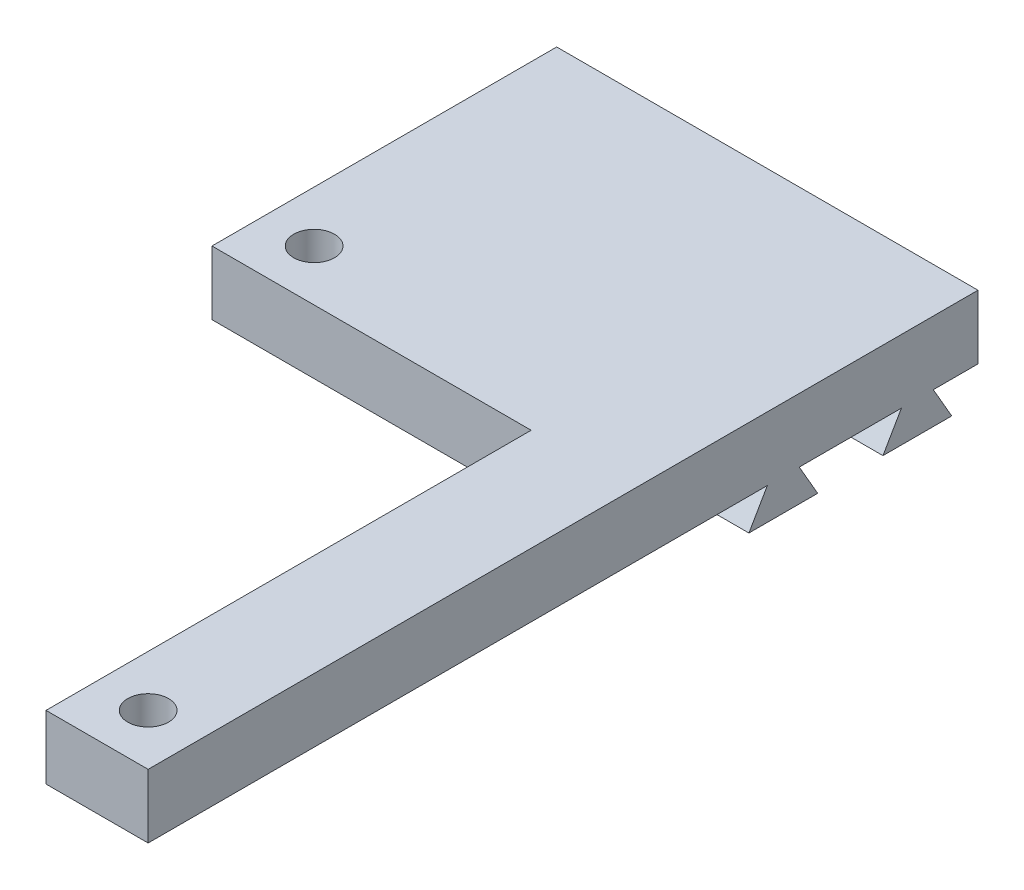
ISO-10303-21;
HEADER;
FILE_DESCRIPTION(('STEP AP214'),'2;1');
FILE_NAME('part.step','',(''),(''),'','','');
FILE_SCHEMA(('AUTOMOTIVE_DESIGN { 1 0 10303 214 1 1 1 1 }'));
ENDSEC;
DATA;
#1=APPLICATION_CONTEXT('core data for automotive mechanical design processes');
#2=APPLICATION_PROTOCOL_DEFINITION('international standard','automotive_design',2000,#1);
#3=PRODUCT_CONTEXT('',#1,'mechanical');
#4=PRODUCT('Part','Part','',(#3));
#5=PRODUCT_RELATED_PRODUCT_CATEGORY('part','',(#4));
#6=PRODUCT_DEFINITION_FORMATION('','',#4);
#7=PRODUCT_DEFINITION_CONTEXT('part definition',#1,'design');
#8=PRODUCT_DEFINITION('design','',#6,#7);
#9=PRODUCT_DEFINITION_SHAPE('','',#8);
#10=(LENGTH_UNIT() NAMED_UNIT(*) SI_UNIT(.MILLI.,.METRE.));
#11=(NAMED_UNIT(*) PLANE_ANGLE_UNIT() SI_UNIT($,.RADIAN.));
#12=(NAMED_UNIT(*) SI_UNIT($,.STERADIAN.) SOLID_ANGLE_UNIT());
#13=UNCERTAINTY_MEASURE_WITH_UNIT(LENGTH_MEASURE(1.E-05),#10,'distance_accuracy_value','');
#14=(GEOMETRIC_REPRESENTATION_CONTEXT(3) GLOBAL_UNCERTAINTY_ASSIGNED_CONTEXT((#13)) GLOBAL_UNIT_ASSIGNED_CONTEXT((#10,
#11,#12)) REPRESENTATION_CONTEXT('',''));
#15=CARTESIAN_POINT('',(0.,0.,0.));
#16=DIRECTION('',(0.,0.,1.));
#17=DIRECTION('',(1.,0.,0.));
#18=AXIS2_PLACEMENT_3D('',#15,#16,#17);
#19=CARTESIAN_POINT('',(0.,0.,0.));
#20=DIRECTION('',(0.,-1.,0.));
#21=DIRECTION('',(0.,0.,-1.));
#22=AXIS2_PLACEMENT_3D('',#19,#20,#21);
#23=PLANE('',#22);
#24=CARTESIAN_POINT('',(-12.5,0.,-7.));
#25=DIRECTION('',(0.,-1.,0.));
#26=DIRECTION('',(0.,0.,-1.));
#27=AXIS2_PLACEMENT_3D('',#24,#25,#26);
#28=CIRCLE('',#27,1.6);
#29=CARTESIAN_POINT('',(-12.5,0.,-8.6));
#30=VERTEX_POINT('',#29);
#31=EDGE_CURVE('E165',#30,#30,#28,.T.);
#32=ORIENTED_EDGE('',*,*,#31,.F.);
#33=EDGE_LOOP('',(#32));
#34=FACE_BOUND('',#33,.T.);
#35=CARTESIAN_POINT('',(12.5,0.,31.));
#36=DIRECTION('',(0.,-1.,0.));
#37=DIRECTION('',(0.,0.,-1.));
#38=AXIS2_PLACEMENT_3D('',#35,#36,#37);
#39=CIRCLE('',#38,1.6);
#40=CARTESIAN_POINT('',(12.5,0.,29.4));
#41=VERTEX_POINT('',#40);
#42=EDGE_CURVE('E168',#41,#41,#39,.T.);
#43=ORIENTED_EDGE('',*,*,#42,.F.);
#44=EDGE_LOOP('',(#43));
#45=FACE_BOUND('',#44,.T.);
#46=DIRECTION('',(0.,0.,1.));
#47=VECTOR('',#46,1.);
#48=CARTESIAN_POINT('',(-16.5,0.,-10.));
#49=LINE('',#48,#47);
#50=CARTESIAN_POINT('',(-16.5,0.,-13.5));
#51=VERTEX_POINT('',#50);
#52=CARTESIAN_POINT('',(-16.5,0.,-3.));
#53=VERTEX_POINT('',#52);
#54=EDGE_CURVE('E243',#51,#53,#49,.T.);
#55=ORIENTED_EDGE('',*,*,#54,.F.);
#56=DIRECTION('',(-1.,0.,0.));
#57=VECTOR('',#56,1.);
#58=CARTESIAN_POINT('',(16.5,0.,-13.5));
#59=LINE('',#58,#57);
#60=CARTESIAN_POINT('',(16.5,0.,-13.5));
#61=VERTEX_POINT('',#60);
#62=EDGE_CURVE('E191',#61,#51,#59,.T.);
#63=ORIENTED_EDGE('',*,*,#62,.F.);
#64=DIRECTION('',(0.,0.,-1.));
#65=VECTOR('',#64,1.);
#66=CARTESIAN_POINT('',(16.5,0.,30.));
#67=LINE('',#66,#65);
#68=CARTESIAN_POINT('',(16.5,0.,35.));
#69=VERTEX_POINT('',#68);
#70=EDGE_CURVE('E155',#69,#61,#67,.T.);
#71=ORIENTED_EDGE('',*,*,#70,.F.);
#72=DIRECTION('',(1.,0.,0.));
#73=VECTOR('',#72,1.);
#74=CARTESIAN_POINT('',(8.5,0.,35.));
#75=LINE('',#74,#73);
#76=CARTESIAN_POINT('',(8.5,0.,35.));
#77=VERTEX_POINT('',#76);
#78=EDGE_CURVE('E151',#77,#69,#75,.T.);
#79=ORIENTED_EDGE('',*,*,#78,.F.);
#80=DIRECTION('',(0.,0.,1.));
#81=VECTOR('',#80,1.);
#82=CARTESIAN_POINT('',(8.5,0.,-10.));
#83=LINE('',#82,#81);
#84=CARTESIAN_POINT('',(8.5,0.,-3.));
#85=VERTEX_POINT('',#84);
#86=EDGE_CURVE('E138',#85,#77,#83,.T.);
#87=ORIENTED_EDGE('',*,*,#86,.F.);
#88=DIRECTION('',(1.,0.,0.));
#89=VECTOR('',#88,1.);
#90=CARTESIAN_POINT('',(-16.5,0.,-3.));
#91=LINE('',#90,#89);
#92=EDGE_CURVE('E177',#53,#85,#91,.T.);
#93=ORIENTED_EDGE('',*,*,#92,.F.);
#94=EDGE_LOOP('',(#55,#63,#71,#79,#87,#93));
#95=FACE_BOUND('',#94,.T.);
#96=ADVANCED_FACE('F36',(#34,#45,#95),#23,.T.);
#97=CARTESIAN_POINT('',(16.5,0.,-16.));
#98=VERTEX_POINT('',#97);
#99=CARTESIAN_POINT('',(16.5,0.,-24.));
#100=VERTEX_POINT('',#99);
#101=EDGE_CURVE('E241',#98,#100,#67,.T.);
#102=ORIENTED_EDGE('',*,*,#101,.F.);
#103=DIRECTION('',(-1.,0.,0.));
#104=VECTOR('',#103,1.);
#105=CARTESIAN_POINT('',(16.5,0.,-16.));
#106=LINE('',#105,#104);
#107=CARTESIAN_POINT('',(-16.5,0.,-16.));
#108=VERTEX_POINT('',#107);
#109=EDGE_CURVE('E203',#98,#108,#106,.T.);
#110=ORIENTED_EDGE('',*,*,#109,.T.);
#111=CARTESIAN_POINT('',(-16.5,0.,-24.));
#112=VERTEX_POINT('',#111);
#113=EDGE_CURVE('E245',#112,#108,#49,.T.);
#114=ORIENTED_EDGE('',*,*,#113,.F.);
#115=DIRECTION('',(-1.,0.,0.));
#116=VECTOR('',#115,1.);
#117=CARTESIAN_POINT('',(16.5,0.,-24.));
#118=LINE('',#117,#116);
#119=EDGE_CURVE('E228',#100,#112,#118,.T.);
#120=ORIENTED_EDGE('',*,*,#119,.F.);
#121=EDGE_LOOP('',(#102,#110,#114,#120));
#122=FACE_BOUND('',#121,.T.);
#123=ADVANCED_FACE('F274',(#122),#23,.T.);
#124=CARTESIAN_POINT('',(16.5,0.,-26.5));
#125=VERTEX_POINT('',#124);
#126=CARTESIAN_POINT('',(16.5,0.,-30.));
#127=VERTEX_POINT('',#126);
#128=EDGE_CURVE('E225',#125,#127,#67,.T.);
#129=ORIENTED_EDGE('',*,*,#128,.F.);
#130=DIRECTION('',(-1.,0.,0.));
#131=VECTOR('',#130,1.);
#132=CARTESIAN_POINT('',(16.5,0.,-26.5));
#133=LINE('',#132,#131);
#134=CARTESIAN_POINT('',(-16.5,0.,-26.5));
#135=VERTEX_POINT('',#134);
#136=EDGE_CURVE('E226',#125,#135,#133,.T.);
#137=ORIENTED_EDGE('',*,*,#136,.T.);
#138=CARTESIAN_POINT('',(-16.5,0.,-30.));
#139=VERTEX_POINT('',#138);
#140=EDGE_CURVE('E148',#139,#135,#49,.T.);
#141=ORIENTED_EDGE('',*,*,#140,.F.);
#142=DIRECTION('',(-1.,0.,0.));
#143=VECTOR('',#142,1.);
#144=CARTESIAN_POINT('',(-16.5,0.,-30.));
#145=LINE('',#144,#143);
#146=EDGE_CURVE('E240',#127,#139,#145,.T.);
#147=ORIENTED_EDGE('',*,*,#146,.F.);
#148=EDGE_LOOP('',(#129,#137,#141,#147));
#149=FACE_BOUND('',#148,.T.);
#150=ADVANCED_FACE('F256',(#149),#23,.T.);
#151=CARTESIAN_POINT('',(16.5,5.,30.));
#152=DIRECTION('',(-1.,0.,0.));
#153=DIRECTION('',(0.,0.,1.));
#154=AXIS2_PLACEMENT_3D('',#151,#152,#153);
#155=PLANE('',#154);
#156=ORIENTED_EDGE('',*,*,#70,.T.);
#157=DIRECTION('',(0.,-0.866025403784436,0.500000000000004));
#158=VECTOR('',#157,1.);
#159=CARTESIAN_POINT('',(16.5,-5.84567147554499,-10.1249999999999));
#160=LINE('',#159,#158);
#161=CARTESIAN_POINT('',(16.5,-2.5,-12.0566243270259));
#162=VERTEX_POINT('',#161);
#163=EDGE_CURVE('E183',#61,#162,#160,.T.);
#164=ORIENTED_EDGE('',*,*,#163,.T.);
#165=DIRECTION('',(0.,0.,-1.));
#166=VECTOR('',#165,1.);
#167=CARTESIAN_POINT('',(16.5,-2.5,0.));
#168=LINE('',#167,#166);
#169=CARTESIAN_POINT('',(16.5,-2.5,-17.4433756729741));
#170=VERTEX_POINT('',#169);
#171=EDGE_CURVE('E189',#162,#170,#168,.T.);
#172=ORIENTED_EDGE('',*,*,#171,.T.);
#173=DIRECTION('',(0.,0.866025403784436,0.500000000000005));
#174=VECTOR('',#173,1.);
#175=CARTESIAN_POINT('',(16.5,6.92820323027555,-11.9999999999999));
#176=LINE('',#175,#174);
#177=EDGE_CURVE('E186',#170,#98,#176,.T.);
#178=ORIENTED_EDGE('',*,*,#177,.T.);
#179=ORIENTED_EDGE('',*,*,#101,.T.);
#180=DIRECTION('',(0.,0.866025403784436,-0.500000000000005));
#181=VECTOR('',#180,1.);
#182=CARTESIAN_POINT('',(16.5,-10.3923048454133,-17.9999999999999));
#183=LINE('',#182,#181);
#184=CARTESIAN_POINT('',(16.5,-2.5,-22.5566243270259));
#185=VERTEX_POINT('',#184);
#186=EDGE_CURVE('E210',#185,#100,#183,.T.);
#187=ORIENTED_EDGE('',*,*,#186,.F.);
#188=DIRECTION('',(0.,0.,1.));
#189=VECTOR('',#188,1.);
#190=CARTESIAN_POINT('',(16.5,-2.5,0.));
#191=LINE('',#190,#189);
#192=CARTESIAN_POINT('',(16.5,-2.5,-27.9433756729741));
#193=VERTEX_POINT('',#192);
#194=EDGE_CURVE('E207',#193,#185,#191,.T.);
#195=ORIENTED_EDGE('',*,*,#194,.F.);
#196=DIRECTION('',(0.,-0.866025403784436,-0.500000000000004));
#197=VECTOR('',#196,1.);
#198=CARTESIAN_POINT('',(16.5,11.4748366001439,-19.8749999999999));
#199=LINE('',#198,#197);
#200=EDGE_CURVE('E213',#125,#193,#199,.T.);
#201=ORIENTED_EDGE('',*,*,#200,.F.);
#202=ORIENTED_EDGE('',*,*,#128,.T.);
#203=DIRECTION('',(0.,-1.,0.));
#204=VECTOR('',#203,1.);
#205=CARTESIAN_POINT('',(16.5,5.,-30.));
#206=LINE('',#205,#204);
#207=CARTESIAN_POINT('',(16.5,5.,-30.));
#208=VERTEX_POINT('',#207);
#209=EDGE_CURVE('E11',#208,#127,#206,.T.);
#210=ORIENTED_EDGE('',*,*,#209,.F.);
#211=DIRECTION('',(0.,0.,-1.));
#212=VECTOR('',#211,1.);
#213=CARTESIAN_POINT('',(16.5,5.,30.));
#214=LINE('',#213,#212);
#215=CARTESIAN_POINT('',(16.5,5.,35.));
#216=VERTEX_POINT('',#215);
#217=EDGE_CURVE('E147',#216,#208,#214,.T.);
#218=ORIENTED_EDGE('',*,*,#217,.F.);
#219=DIRECTION('',(0.,1.,0.));
#220=VECTOR('',#219,1.);
#221=CARTESIAN_POINT('',(16.5,5.,35.));
#222=LINE('',#221,#220);
#223=EDGE_CURVE('E159',#69,#216,#222,.T.);
#224=ORIENTED_EDGE('',*,*,#223,.F.);
#225=EDGE_LOOP('',(#156,#164,#172,#178,#179,#187,#195,#201,#202,#210,#218,#224));
#226=FACE_BOUND('',#225,.T.);
#227=ADVANCED_FACE('F38',(#226),#155,.F.);
#228=CARTESIAN_POINT('',(-16.5,5.,-30.));
#229=DIRECTION('',(0.,0.,1.));
#230=DIRECTION('',(1.,0.,0.));
#231=AXIS2_PLACEMENT_3D('',#228,#229,#230);
#232=PLANE('',#231);
#233=ORIENTED_EDGE('',*,*,#146,.T.);
#234=DIRECTION('',(0.,-1.,0.));
#235=VECTOR('',#234,1.);
#236=CARTESIAN_POINT('',(-16.5,5.,-30.));
#237=LINE('',#236,#235);
#238=CARTESIAN_POINT('',(-16.5,5.,-30.));
#239=VERTEX_POINT('',#238);
#240=EDGE_CURVE('E44',#239,#139,#237,.T.);
#241=ORIENTED_EDGE('',*,*,#240,.F.);
#242=DIRECTION('',(-1.,0.,0.));
#243=VECTOR('',#242,1.);
#244=CARTESIAN_POINT('',(-16.5,5.,-30.));
#245=LINE('',#244,#243);
#246=EDGE_CURVE('E233',#208,#239,#245,.T.);
#247=ORIENTED_EDGE('',*,*,#246,.F.);
#248=ORIENTED_EDGE('',*,*,#209,.T.);
#249=EDGE_LOOP('',(#233,#241,#247,#248));
#250=FACE_BOUND('',#249,.T.);
#251=ADVANCED_FACE('F281',(#250),#232,.F.);
#252=CARTESIAN_POINT('',(-16.5,5.,-10.));
#253=DIRECTION('',(1.,0.,0.));
#254=DIRECTION('',(0.,0.,-1.));
#255=AXIS2_PLACEMENT_3D('',#252,#253,#254);
#256=PLANE('',#255);
#257=ORIENTED_EDGE('',*,*,#140,.T.);
#258=DIRECTION('',(0.,-0.866025403784436,-0.500000000000004));
#259=VECTOR('',#258,1.);
#260=CARTESIAN_POINT('',(-16.5,11.4748366001439,-19.8749999999999));
#261=LINE('',#260,#259);
#262=CARTESIAN_POINT('',(-16.5,-2.5,-27.9433756729741));
#263=VERTEX_POINT('',#262);
#264=EDGE_CURVE('E59',#135,#263,#261,.T.);
#265=ORIENTED_EDGE('',*,*,#264,.T.);
#266=DIRECTION('',(0.,0.,1.));
#267=VECTOR('',#266,1.);
#268=CARTESIAN_POINT('',(-16.5,-2.5,0.));
#269=LINE('',#268,#267);
#270=CARTESIAN_POINT('',(-16.5,-2.5,-22.5566243270259));
#271=VERTEX_POINT('',#270);
#272=EDGE_CURVE('E199',#263,#271,#269,.T.);
#273=ORIENTED_EDGE('',*,*,#272,.T.);
#274=DIRECTION('',(0.,0.866025403784436,-0.500000000000005));
#275=VECTOR('',#274,1.);
#276=CARTESIAN_POINT('',(-16.5,-10.3923048454133,-17.9999999999999));
#277=LINE('',#276,#275);
#278=EDGE_CURVE('E219',#271,#112,#277,.T.);
#279=ORIENTED_EDGE('',*,*,#278,.T.);
#280=ORIENTED_EDGE('',*,*,#113,.T.);
#281=DIRECTION('',(0.,0.866025403784436,0.500000000000005));
#282=VECTOR('',#281,1.);
#283=CARTESIAN_POINT('',(-16.5,6.92820323027555,-11.9999999999999));
#284=LINE('',#283,#282);
#285=CARTESIAN_POINT('',(-16.5,-2.5,-17.4433756729741));
#286=VERTEX_POINT('',#285);
#287=EDGE_CURVE('E193',#286,#108,#284,.T.);
#288=ORIENTED_EDGE('',*,*,#287,.F.);
#289=DIRECTION('',(0.,0.,-1.));
#290=VECTOR('',#289,1.);
#291=CARTESIAN_POINT('',(-16.5,-2.5,0.));
#292=LINE('',#291,#290);
#293=CARTESIAN_POINT('',(-16.5,-2.5,-12.0566243270259));
#294=VERTEX_POINT('',#293);
#295=EDGE_CURVE('E187',#294,#286,#292,.T.);
#296=ORIENTED_EDGE('',*,*,#295,.F.);
#297=DIRECTION('',(0.,-0.866025403784436,0.500000000000004));
#298=VECTOR('',#297,1.);
#299=CARTESIAN_POINT('',(-16.5,-5.84567147554499,-10.1249999999999));
#300=LINE('',#299,#298);
#301=EDGE_CURVE('E51',#51,#294,#300,.T.);
#302=ORIENTED_EDGE('',*,*,#301,.F.);
#303=ORIENTED_EDGE('',*,*,#54,.T.);
#304=DIRECTION('',(0.,-1.,0.));
#305=VECTOR('',#304,1.);
#306=CARTESIAN_POINT('',(-16.5,5.,-3.));
#307=LINE('',#306,#305);
#308=CARTESIAN_POINT('',(-16.5,5.,-3.));
#309=VERTEX_POINT('',#308);
#310=EDGE_CURVE('E174',#309,#53,#307,.T.);
#311=ORIENTED_EDGE('',*,*,#310,.F.);
#312=DIRECTION('',(0.,0.,1.));
#313=VECTOR('',#312,1.);
#314=CARTESIAN_POINT('',(-16.5,5.,-10.));
#315=LINE('',#314,#313);
#316=EDGE_CURVE('E235',#239,#309,#315,.T.);
#317=ORIENTED_EDGE('',*,*,#316,.F.);
#318=ORIENTED_EDGE('',*,*,#240,.T.);
#319=EDGE_LOOP('',(#257,#265,#273,#279,#280,#288,#296,#302,#303,#311,#317,#318));
#320=FACE_BOUND('',#319,.T.);
#321=ADVANCED_FACE('F250',(#320),#256,.F.);
#322=CARTESIAN_POINT('',(8.5,5.,-10.));
#323=DIRECTION('',(1.,0.,0.));
#324=DIRECTION('',(0.,0.,-1.));
#325=AXIS2_PLACEMENT_3D('',#322,#323,#324);
#326=PLANE('',#325);
#327=DIRECTION('',(0.,0.,1.));
#328=VECTOR('',#327,1.);
#329=CARTESIAN_POINT('',(8.5,5.,-10.));
#330=LINE('',#329,#328);
#331=CARTESIAN_POINT('',(8.5,5.,-3.));
#332=VERTEX_POINT('',#331);
#333=CARTESIAN_POINT('',(8.5,5.,35.));
#334=VERTEX_POINT('',#333);
#335=EDGE_CURVE('E237',#332,#334,#330,.T.);
#336=ORIENTED_EDGE('',*,*,#335,.F.);
#337=DIRECTION('',(0.,1.,0.));
#338=VECTOR('',#337,1.);
#339=CARTESIAN_POINT('',(8.5,5.,-3.));
#340=LINE('',#339,#338);
#341=EDGE_CURVE('E144',#85,#332,#340,.T.);
#342=ORIENTED_EDGE('',*,*,#341,.F.);
#343=ORIENTED_EDGE('',*,*,#86,.T.);
#344=DIRECTION('',(0.,-1.,0.));
#345=VECTOR('',#344,1.);
#346=CARTESIAN_POINT('',(8.5,5.,35.));
#347=LINE('',#346,#345);
#348=EDGE_CURVE('E143',#334,#77,#347,.T.);
#349=ORIENTED_EDGE('',*,*,#348,.F.);
#350=EDGE_LOOP('',(#336,#342,#343,#349));
#351=FACE_BOUND('',#350,.T.);
#352=ADVANCED_FACE('F141',(#351),#326,.F.);
#353=CARTESIAN_POINT('',(0.,5.,0.));
#354=DIRECTION('',(0.,-1.,0.));
#355=DIRECTION('',(0.,0.,-1.));
#356=AXIS2_PLACEMENT_3D('',#353,#354,#355);
#357=PLANE('',#356);
#358=CARTESIAN_POINT('',(-12.5,5.,-7.));
#359=DIRECTION('',(0.,1.,0.));
#360=DIRECTION('',(0.,0.,1.));
#361=AXIS2_PLACEMENT_3D('',#358,#359,#360);
#362=CIRCLE('',#361,1.6);
#363=CARTESIAN_POINT('',(-12.5,5.,-5.4));
#364=VERTEX_POINT('',#363);
#365=EDGE_CURVE('E333',#364,#364,#362,.T.);
#366=ORIENTED_EDGE('',*,*,#365,.F.);
#367=EDGE_LOOP('',(#366));
#368=FACE_BOUND('',#367,.T.);
#369=CARTESIAN_POINT('',(12.5,5.,31.));
#370=DIRECTION('',(0.,1.,0.));
#371=DIRECTION('',(0.,0.,1.));
#372=AXIS2_PLACEMENT_3D('',#369,#370,#371);
#373=CIRCLE('',#372,1.6);
#374=CARTESIAN_POINT('',(12.5,5.,32.6));
#375=VERTEX_POINT('',#374);
#376=EDGE_CURVE('E336',#375,#375,#373,.T.);
#377=ORIENTED_EDGE('',*,*,#376,.F.);
#378=EDGE_LOOP('',(#377));
#379=FACE_BOUND('',#378,.T.);
#380=DIRECTION('',(-1.,0.,0.));
#381=VECTOR('',#380,1.);
#382=CARTESIAN_POINT('',(-16.5,5.,-3.));
#383=LINE('',#382,#381);
#384=EDGE_CURVE('E180',#332,#309,#383,.T.);
#385=ORIENTED_EDGE('',*,*,#384,.F.);
#386=ORIENTED_EDGE('',*,*,#335,.T.);
#387=DIRECTION('',(-1.,0.,0.));
#388=VECTOR('',#387,1.);
#389=CARTESIAN_POINT('',(8.5,5.,35.));
#390=LINE('',#389,#388);
#391=EDGE_CURVE('E164',#216,#334,#390,.T.);
#392=ORIENTED_EDGE('',*,*,#391,.F.);
#393=ORIENTED_EDGE('',*,*,#217,.T.);
#394=ORIENTED_EDGE('',*,*,#246,.T.);
#395=ORIENTED_EDGE('',*,*,#316,.T.);
#396=EDGE_LOOP('',(#385,#386,#392,#393,#394,#395));
#397=FACE_BOUND('',#396,.T.);
#398=ADVANCED_FACE('F280',(#368,#379,#397),#357,.F.);
#399=CARTESIAN_POINT('',(16.5,-2.5,0.));
#400=DIRECTION('',(0.,-1.,0.));
#401=DIRECTION('',(0.,0.,-1.));
#402=AXIS2_PLACEMENT_3D('',#399,#400,#401);
#403=PLANE('',#402);
#404=ORIENTED_EDGE('',*,*,#272,.F.);
#405=DIRECTION('',(-1.,0.,0.));
#406=VECTOR('',#405,1.);
#407=CARTESIAN_POINT('',(16.5,-2.5,-27.9433756729741));
#408=LINE('',#407,#406);
#409=EDGE_CURVE('E223',#193,#263,#408,.T.);
#410=ORIENTED_EDGE('',*,*,#409,.F.);
#411=ORIENTED_EDGE('',*,*,#194,.T.);
#412=DIRECTION('',(-1.,0.,0.));
#413=VECTOR('',#412,1.);
#414=CARTESIAN_POINT('',(16.5,-2.5,-22.5566243270259));
#415=LINE('',#414,#413);
#416=EDGE_CURVE('E216',#185,#271,#415,.T.);
#417=ORIENTED_EDGE('',*,*,#416,.T.);
#418=EDGE_LOOP('',(#404,#410,#411,#417));
#419=FACE_BOUND('',#418,.T.);
#420=ADVANCED_FACE('F265',(#419),#403,.T.);
#421=CARTESIAN_POINT('',(16.5,11.4748366001439,-19.8749999999999));
#422=DIRECTION('',(0.,0.500000000000004,-0.866025403784436));
#423=DIRECTION('',(0.,0.866025403784436,0.500000000000004));
#424=AXIS2_PLACEMENT_3D('',#421,#422,#423);
#425=PLANE('',#424);
#426=ORIENTED_EDGE('',*,*,#264,.F.);
#427=ORIENTED_EDGE('',*,*,#136,.F.);
#428=ORIENTED_EDGE('',*,*,#200,.T.);
#429=ORIENTED_EDGE('',*,*,#409,.T.);
#430=EDGE_LOOP('',(#426,#427,#428,#429));
#431=FACE_BOUND('',#430,.T.);
#432=ADVANCED_FACE('F258',(#431),#425,.T.);
#433=CARTESIAN_POINT('',(16.5,-10.3923048454133,-17.9999999999999));
#434=DIRECTION('',(0.,0.500000000000005,0.866025403784436));
#435=DIRECTION('',(0.,-0.866025403784436,0.500000000000005));
#436=AXIS2_PLACEMENT_3D('',#433,#434,#435);
#437=PLANE('',#436);
#438=ORIENTED_EDGE('',*,*,#278,.F.);
#439=ORIENTED_EDGE('',*,*,#416,.F.);
#440=ORIENTED_EDGE('',*,*,#186,.T.);
#441=ORIENTED_EDGE('',*,*,#119,.T.);
#442=EDGE_LOOP('',(#438,#439,#440,#441));
#443=FACE_BOUND('',#442,.T.);
#444=ADVANCED_FACE('F291',(#443),#437,.T.);
#445=CARTESIAN_POINT('',(16.5,-5.84567147554499,-10.1249999999999));
#446=DIRECTION('',(0.,-0.500000000000004,-0.866025403784436));
#447=DIRECTION('',(0.,0.866025403784436,-0.500000000000004));
#448=AXIS2_PLACEMENT_3D('',#445,#446,#447);
#449=PLANE('',#448);
#450=ORIENTED_EDGE('',*,*,#301,.T.);
#451=DIRECTION('',(-1.,0.,0.));
#452=VECTOR('',#451,1.);
#453=CARTESIAN_POINT('',(16.5,-2.5,-12.0566243270259));
#454=LINE('',#453,#452);
#455=EDGE_CURVE('E196',#162,#294,#454,.T.);
#456=ORIENTED_EDGE('',*,*,#455,.F.);
#457=ORIENTED_EDGE('',*,*,#163,.F.);
#458=ORIENTED_EDGE('',*,*,#62,.T.);
#459=EDGE_LOOP('',(#450,#456,#457,#458));
#460=FACE_BOUND('',#459,.T.);
#461=ADVANCED_FACE('F285',(#460),#449,.F.);
#462=CARTESIAN_POINT('',(16.5,-2.5,0.));
#463=DIRECTION('',(0.,1.,0.));
#464=DIRECTION('',(0.,0.,1.));
#465=AXIS2_PLACEMENT_3D('',#462,#463,#464);
#466=PLANE('',#465);
#467=ORIENTED_EDGE('',*,*,#295,.T.);
#468=DIRECTION('',(-1.,0.,0.));
#469=VECTOR('',#468,1.);
#470=CARTESIAN_POINT('',(16.5,-2.5,-17.4433756729741));
#471=LINE('',#470,#469);
#472=EDGE_CURVE('E200',#170,#286,#471,.T.);
#473=ORIENTED_EDGE('',*,*,#472,.F.);
#474=ORIENTED_EDGE('',*,*,#171,.F.);
#475=ORIENTED_EDGE('',*,*,#455,.T.);
#476=EDGE_LOOP('',(#467,#473,#474,#475));
#477=FACE_BOUND('',#476,.T.);
#478=ADVANCED_FACE('F287',(#477),#466,.F.);
#479=CARTESIAN_POINT('',(16.5,6.92820323027555,-11.9999999999999));
#480=DIRECTION('',(0.,-0.500000000000005,0.866025403784436));
#481=DIRECTION('',(0.,-0.866025403784436,-0.500000000000005));
#482=AXIS2_PLACEMENT_3D('',#479,#480,#481);
#483=PLANE('',#482);
#484=ORIENTED_EDGE('',*,*,#287,.T.);
#485=ORIENTED_EDGE('',*,*,#109,.F.);
#486=ORIENTED_EDGE('',*,*,#177,.F.);
#487=ORIENTED_EDGE('',*,*,#472,.T.);
#488=EDGE_LOOP('',(#484,#485,#486,#487));
#489=FACE_BOUND('',#488,.T.);
#490=ADVANCED_FACE('F290',(#489),#483,.F.);
#491=CARTESIAN_POINT('',(0.,0.,-3.));
#492=DIRECTION('',(0.,0.,1.));
#493=DIRECTION('',(1.,0.,0.));
#494=AXIS2_PLACEMENT_3D('',#491,#492,#493);
#495=PLANE('',#494);
#496=ORIENTED_EDGE('',*,*,#310,.T.);
#497=ORIENTED_EDGE('',*,*,#92,.T.);
#498=ORIENTED_EDGE('',*,*,#341,.T.);
#499=ORIENTED_EDGE('',*,*,#384,.T.);
#500=EDGE_LOOP('',(#496,#497,#498,#499));
#501=FACE_BOUND('',#500,.T.);
#502=ADVANCED_FACE('F277',(#501),#495,.T.);
#503=CARTESIAN_POINT('',(0.,0.,35.));
#504=DIRECTION('',(0.,0.,1.));
#505=DIRECTION('',(1.,0.,0.));
#506=AXIS2_PLACEMENT_3D('',#503,#504,#505);
#507=PLANE('',#506);
#508=ORIENTED_EDGE('',*,*,#348,.T.);
#509=ORIENTED_EDGE('',*,*,#78,.T.);
#510=ORIENTED_EDGE('',*,*,#223,.T.);
#511=ORIENTED_EDGE('',*,*,#391,.T.);
#512=EDGE_LOOP('',(#508,#509,#510,#511));
#513=FACE_BOUND('',#512,.T.);
#514=ADVANCED_FACE('F162',(#513),#507,.T.);
#515=CARTESIAN_POINT('',(12.5,-2.5,31.));
#516=DIRECTION('',(0.,1.,0.));
#517=DIRECTION('',(0.,0.,1.));
#518=AXIS2_PLACEMENT_3D('',#515,#516,#517);
#519=CYLINDRICAL_SURFACE('',#518,1.6);
#520=ORIENTED_EDGE('',*,*,#42,.T.);
#521=EDGE_LOOP('',(#520));
#522=FACE_BOUND('',#521,.T.);
#523=ORIENTED_EDGE('',*,*,#376,.T.);
#524=EDGE_LOOP('',(#523));
#525=FACE_BOUND('',#524,.T.);
#526=ADVANCED_FACE('F343',(#522,#525),#519,.F.);
#527=CARTESIAN_POINT('',(-12.5,-2.5,-7.));
#528=DIRECTION('',(0.,1.,0.));
#529=DIRECTION('',(0.,0.,1.));
#530=AXIS2_PLACEMENT_3D('',#527,#528,#529);
#531=CYLINDRICAL_SURFACE('',#530,1.6);
#532=ORIENTED_EDGE('',*,*,#31,.T.);
#533=EDGE_LOOP('',(#532));
#534=FACE_BOUND('',#533,.T.);
#535=ORIENTED_EDGE('',*,*,#365,.T.);
#536=EDGE_LOOP('',(#535));
#537=FACE_BOUND('',#536,.T.);
#538=ADVANCED_FACE('F345',(#534,#537),#531,.F.);
#539=CLOSED_SHELL('',(#96,#123,#150,#227,#251,#321,#352,#398,#420,#432,#444,#461,#478,#490,#502,
#514,#526,#538));
#540=MANIFOLD_SOLID_BREP('B2',#539);
#541=ADVANCED_BREP_SHAPE_REPRESENTATION('',(#18,#540),#14);
#542=SHAPE_DEFINITION_REPRESENTATION(#9,#541);
ENDSEC;
END-ISO-10303-21;
